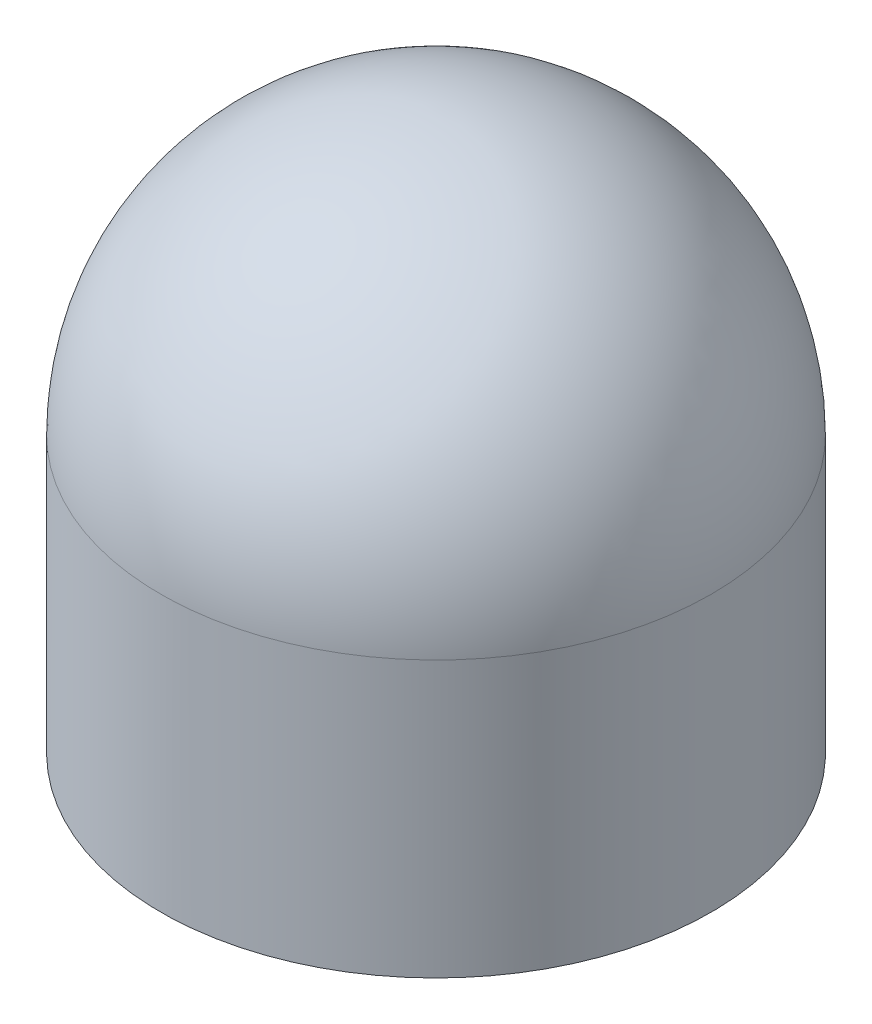
ISO-10303-21;
HEADER;
FILE_DESCRIPTION(('STEP AP214'),'2;1');
FILE_NAME('part.step','',(''),(''),'','','');
FILE_SCHEMA(('AUTOMOTIVE_DESIGN { 1 0 10303 214 1 1 1 1 }'));
ENDSEC;
DATA;
#1=APPLICATION_CONTEXT('core data for automotive mechanical design processes');
#2=APPLICATION_PROTOCOL_DEFINITION('international standard','automotive_design',2000,#1);
#3=PRODUCT_CONTEXT('',#1,'mechanical');
#4=PRODUCT('Part','Part','',(#3));
#5=PRODUCT_RELATED_PRODUCT_CATEGORY('part','',(#4));
#6=PRODUCT_DEFINITION_FORMATION('','',#4);
#7=PRODUCT_DEFINITION_CONTEXT('part definition',#1,'design');
#8=PRODUCT_DEFINITION('design','',#6,#7);
#9=PRODUCT_DEFINITION_SHAPE('','',#8);
#10=(LENGTH_UNIT() NAMED_UNIT(*) SI_UNIT(.MILLI.,.METRE.));
#11=(NAMED_UNIT(*) PLANE_ANGLE_UNIT() SI_UNIT($,.RADIAN.));
#12=(NAMED_UNIT(*) SI_UNIT($,.STERADIAN.) SOLID_ANGLE_UNIT());
#13=UNCERTAINTY_MEASURE_WITH_UNIT(LENGTH_MEASURE(1.E-05),#10,'distance_accuracy_value','');
#14=(GEOMETRIC_REPRESENTATION_CONTEXT(3) GLOBAL_UNCERTAINTY_ASSIGNED_CONTEXT((#13)) GLOBAL_UNIT_ASSIGNED_CONTEXT((#10,
#11,#12)) REPRESENTATION_CONTEXT('',''));
#15=CARTESIAN_POINT('',(0.,0.,0.));
#16=DIRECTION('',(0.,0.,1.));
#17=DIRECTION('',(1.,0.,0.));
#18=AXIS2_PLACEMENT_3D('',#15,#16,#17);
#19=CARTESIAN_POINT('',(0.,0.,0.));
#20=DIRECTION('',(0.,-1.,0.));
#21=DIRECTION('',(0.,0.,-1.));
#22=AXIS2_PLACEMENT_3D('',#19,#20,#21);
#23=PLANE('',#22);
#24=CARTESIAN_POINT('',(0.,0.,0.));
#25=DIRECTION('',(0.,-1.,0.));
#26=DIRECTION('',(0.,0.,-1.));
#27=AXIS2_PLACEMENT_3D('',#24,#25,#26);
#28=CIRCLE('',#27,30.);
#29=CARTESIAN_POINT('',(0.,0.,-30.));
#30=VERTEX_POINT('',#29);
#31=EDGE_CURVE('E10',#30,#30,#28,.T.);
#32=ORIENTED_EDGE('',*,*,#31,.T.);
#33=EDGE_LOOP('',(#32));
#34=FACE_BOUND('',#33,.T.);
#35=ADVANCED_FACE('F33',(#34),#23,.T.);
#36=CARTESIAN_POINT('',(0.,0.,0.));
#37=DIRECTION('',(0.,-1.,0.));
#38=DIRECTION('',(0.,0.,-1.));
#39=AXIS2_PLACEMENT_3D('',#36,#37,#38);
#40=CYLINDRICAL_SURFACE('',#39,30.);
#41=CARTESIAN_POINT('',(0.,30.,0.));
#42=DIRECTION('',(0.,-1.,0.));
#43=DIRECTION('',(0.,0.,-1.));
#44=AXIS2_PLACEMENT_3D('',#41,#42,#43);
#45=CIRCLE('',#44,30.);
#46=CARTESIAN_POINT('',(0.,30.,-30.));
#47=VERTEX_POINT('',#46);
#48=EDGE_CURVE('E39',#47,#47,#45,.T.);
#49=ORIENTED_EDGE('',*,*,#48,.T.);
#50=EDGE_LOOP('',(#49));
#51=FACE_BOUND('',#50,.T.);
#52=ORIENTED_EDGE('',*,*,#31,.F.);
#53=EDGE_LOOP('',(#52));
#54=FACE_BOUND('',#53,.T.);
#55=ADVANCED_FACE('F45',(#51,#54),#40,.T.);
#56=CARTESIAN_POINT('',(0.,30.,0.));
#57=DIRECTION('',(0.,-1.,0.));
#58=DIRECTION('',(1.,0.,0.));
#59=AXIS2_PLACEMENT_3D('',#56,#57,#58);
#60=SPHERICAL_SURFACE('',#59,30.);
#61=ORIENTED_EDGE('',*,*,#48,.F.);
#62=EDGE_LOOP('',(#61));
#63=FACE_BOUND('',#62,.T.);
#64=ADVANCED_FACE('F48',(#63),#60,.T.);
#65=CLOSED_SHELL('',(#35,#55,#64));
#66=MANIFOLD_SOLID_BREP('B2',#65);
#67=ADVANCED_BREP_SHAPE_REPRESENTATION('',(#18,#66),#14);
#68=SHAPE_DEFINITION_REPRESENTATION(#9,#67);
ENDSEC;
END-ISO-10303-21;
